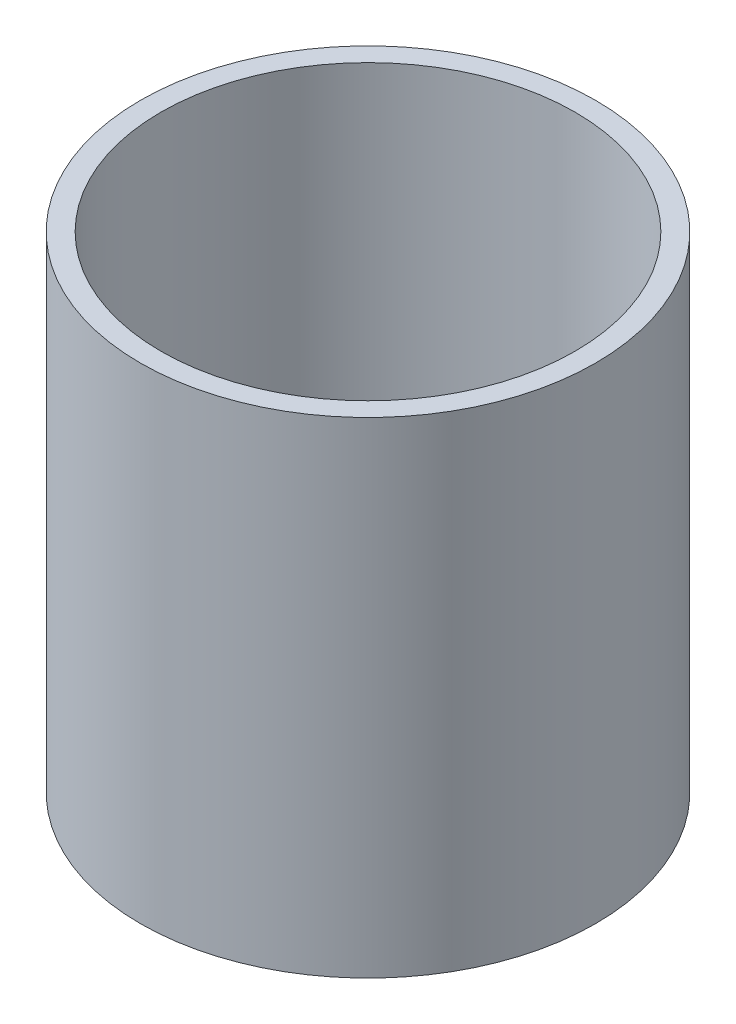
ISO-10303-21;
HEADER;
FILE_DESCRIPTION(('STEP AP214'),'2;1');
FILE_NAME('part.step','',(''),(''),'','','');
FILE_SCHEMA(('AUTOMOTIVE_DESIGN { 1 0 10303 214 1 1 1 1 }'));
ENDSEC;
DATA;
#1=APPLICATION_CONTEXT('core data for automotive mechanical design processes');
#2=APPLICATION_PROTOCOL_DEFINITION('international standard','automotive_design',2000,#1);
#3=PRODUCT_CONTEXT('',#1,'mechanical');
#4=PRODUCT('Part','Part','',(#3));
#5=PRODUCT_RELATED_PRODUCT_CATEGORY('part','',(#4));
#6=PRODUCT_DEFINITION_FORMATION('','',#4);
#7=PRODUCT_DEFINITION_CONTEXT('part definition',#1,'design');
#8=PRODUCT_DEFINITION('design','',#6,#7);
#9=PRODUCT_DEFINITION_SHAPE('','',#8);
#10=(LENGTH_UNIT() NAMED_UNIT(*) SI_UNIT(.MILLI.,.METRE.));
#11=(NAMED_UNIT(*) PLANE_ANGLE_UNIT() SI_UNIT($,.RADIAN.));
#12=(NAMED_UNIT(*) SI_UNIT($,.STERADIAN.) SOLID_ANGLE_UNIT());
#13=UNCERTAINTY_MEASURE_WITH_UNIT(LENGTH_MEASURE(1.E-05),#10,'distance_accuracy_value','');
#14=(GEOMETRIC_REPRESENTATION_CONTEXT(3) GLOBAL_UNCERTAINTY_ASSIGNED_CONTEXT((#13)) GLOBAL_UNIT_ASSIGNED_CONTEXT((#10,
#11,#12)) REPRESENTATION_CONTEXT('',''));
#15=CARTESIAN_POINT('',(0.,0.,0.));
#16=DIRECTION('',(0.,0.,1.));
#17=DIRECTION('',(1.,0.,0.));
#18=AXIS2_PLACEMENT_3D('',#15,#16,#17);
#19=CARTESIAN_POINT('',(0.,40.64,0.));
#20=DIRECTION('',(0.,1.,0.));
#21=DIRECTION('',(0.,0.,1.));
#22=AXIS2_PLACEMENT_3D('',#19,#20,#21);
#23=PLANE('',#22);
#24=CARTESIAN_POINT('',(0.,40.64,0.));
#25=DIRECTION('',(0.,1.,0.));
#26=DIRECTION('',(0.,0.,1.));
#27=AXIS2_PLACEMENT_3D('',#24,#25,#26);
#28=CIRCLE('',#27,19.05);
#29=CARTESIAN_POINT('',(0.,40.64,19.05));
#30=VERTEX_POINT('',#29);
#31=EDGE_CURVE('E10',#30,#30,#28,.T.);
#32=ORIENTED_EDGE('',*,*,#31,.T.);
#33=EDGE_LOOP('',(#32));
#34=FACE_BOUND('',#33,.T.);
#35=CARTESIAN_POINT('',(0.,40.64,0.));
#36=DIRECTION('',(0.,1.,0.));
#37=DIRECTION('',(0.,0.,1.));
#38=AXIS2_PLACEMENT_3D('',#35,#36,#37);
#39=CIRCLE('',#38,17.3355);
#40=CARTESIAN_POINT('',(0.,40.64,17.3355));
#41=VERTEX_POINT('',#40);
#42=EDGE_CURVE('E50',#41,#41,#39,.T.);
#43=ORIENTED_EDGE('',*,*,#42,.F.);
#44=EDGE_LOOP('',(#43));
#45=FACE_BOUND('',#44,.T.);
#46=ADVANCED_FACE('F39',(#34,#45),#23,.T.);
#47=CARTESIAN_POINT('',(0.,0.,0.));
#48=DIRECTION('',(0.,1.,0.));
#49=DIRECTION('',(0.,0.,1.));
#50=AXIS2_PLACEMENT_3D('',#47,#48,#49);
#51=PLANE('',#50);
#52=CARTESIAN_POINT('',(0.,0.,0.));
#53=DIRECTION('',(0.,1.,0.));
#54=DIRECTION('',(0.,0.,1.));
#55=AXIS2_PLACEMENT_3D('',#52,#53,#54);
#56=CIRCLE('',#55,19.05);
#57=CARTESIAN_POINT('',(0.,0.,19.05));
#58=VERTEX_POINT('',#57);
#59=EDGE_CURVE('E43',#58,#58,#56,.T.);
#60=ORIENTED_EDGE('',*,*,#59,.F.);
#61=EDGE_LOOP('',(#60));
#62=FACE_BOUND('',#61,.T.);
#63=CARTESIAN_POINT('',(0.,0.,0.));
#64=DIRECTION('',(0.,1.,0.));
#65=DIRECTION('',(0.,0.,1.));
#66=AXIS2_PLACEMENT_3D('',#63,#64,#65);
#67=CIRCLE('',#66,17.3355);
#68=CARTESIAN_POINT('',(0.,0.,17.3355));
#69=VERTEX_POINT('',#68);
#70=EDGE_CURVE('E52',#69,#69,#67,.T.);
#71=ORIENTED_EDGE('',*,*,#70,.T.);
#72=EDGE_LOOP('',(#71));
#73=FACE_BOUND('',#72,.T.);
#74=ADVANCED_FACE('F62',(#62,#73),#51,.F.);
#75=CARTESIAN_POINT('',(0.,40.64,0.));
#76=DIRECTION('',(0.,-1.,0.));
#77=DIRECTION('',(0.,0.,-1.));
#78=AXIS2_PLACEMENT_3D('',#75,#76,#77);
#79=CYLINDRICAL_SURFACE('',#78,19.05);
#80=ORIENTED_EDGE('',*,*,#31,.F.);
#81=EDGE_LOOP('',(#80));
#82=FACE_BOUND('',#81,.T.);
#83=ORIENTED_EDGE('',*,*,#59,.T.);
#84=EDGE_LOOP('',(#83));
#85=FACE_BOUND('',#84,.T.);
#86=ADVANCED_FACE('F41',(#82,#85),#79,.T.);
#87=CARTESIAN_POINT('',(0.,40.64,0.));
#88=DIRECTION('',(0.,-1.,0.));
#89=DIRECTION('',(0.,0.,-1.));
#90=AXIS2_PLACEMENT_3D('',#87,#88,#89);
#91=CYLINDRICAL_SURFACE('',#90,17.3355);
#92=ORIENTED_EDGE('',*,*,#42,.T.);
#93=EDGE_LOOP('',(#92));
#94=FACE_BOUND('',#93,.T.);
#95=ORIENTED_EDGE('',*,*,#70,.F.);
#96=EDGE_LOOP('',(#95));
#97=FACE_BOUND('',#96,.T.);
#98=ADVANCED_FACE('F58',(#94,#97),#91,.F.);
#99=CLOSED_SHELL('',(#46,#74,#86,#98));
#100=MANIFOLD_SOLID_BREP('B2',#99);
#101=ADVANCED_BREP_SHAPE_REPRESENTATION('',(#18,#100),#14);
#102=SHAPE_DEFINITION_REPRESENTATION(#9,#101);
ENDSEC;
END-ISO-10303-21;
